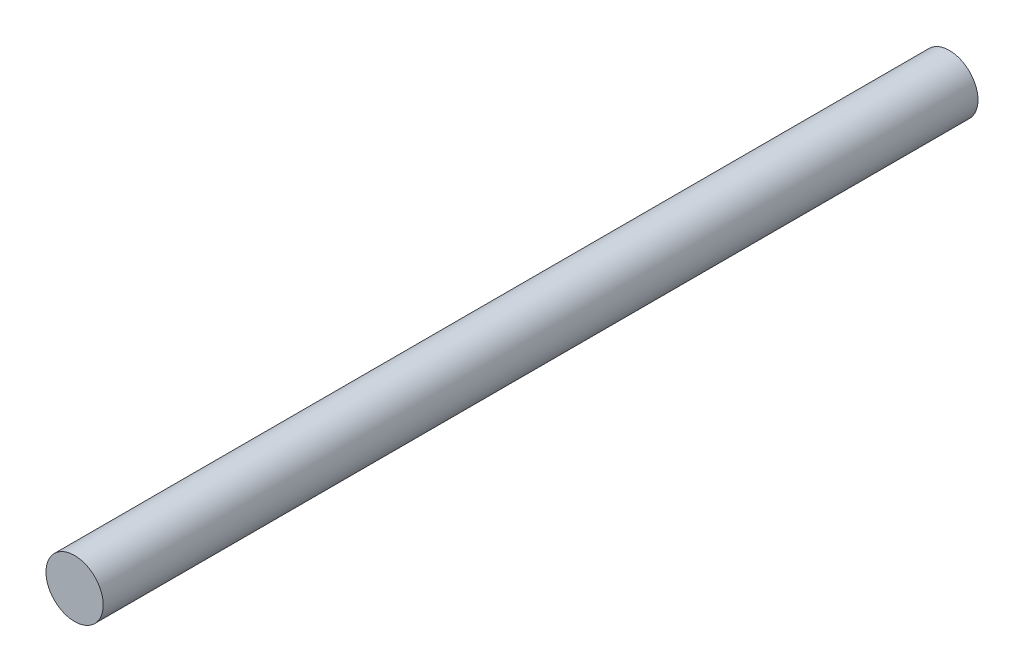
ISO-10303-21;
HEADER;
FILE_DESCRIPTION(('STEP AP214'),'2;1');
FILE_NAME('part.step','',(''),(''),'','','');
FILE_SCHEMA(('AUTOMOTIVE_DESIGN { 1 0 10303 214 1 1 1 1 }'));
ENDSEC;
DATA;
#1=APPLICATION_CONTEXT('core data for automotive mechanical design processes');
#2=APPLICATION_PROTOCOL_DEFINITION('international standard','automotive_design',2000,#1);
#3=PRODUCT_CONTEXT('',#1,'mechanical');
#4=PRODUCT('Part','Part','',(#3));
#5=PRODUCT_RELATED_PRODUCT_CATEGORY('part','',(#4));
#6=PRODUCT_DEFINITION_FORMATION('','',#4);
#7=PRODUCT_DEFINITION_CONTEXT('part definition',#1,'design');
#8=PRODUCT_DEFINITION('design','',#6,#7);
#9=PRODUCT_DEFINITION_SHAPE('','',#8);
#10=(LENGTH_UNIT() NAMED_UNIT(*) SI_UNIT(.MILLI.,.METRE.));
#11=(NAMED_UNIT(*) PLANE_ANGLE_UNIT() SI_UNIT($,.RADIAN.));
#12=(NAMED_UNIT(*) SI_UNIT($,.STERADIAN.) SOLID_ANGLE_UNIT());
#13=UNCERTAINTY_MEASURE_WITH_UNIT(LENGTH_MEASURE(1.E-05),#10,'distance_accuracy_value','');
#14=(GEOMETRIC_REPRESENTATION_CONTEXT(3) GLOBAL_UNCERTAINTY_ASSIGNED_CONTEXT((#13)) GLOBAL_UNIT_ASSIGNED_CONTEXT((#10,
#11,#12)) REPRESENTATION_CONTEXT('',''));
#15=CARTESIAN_POINT('',(0.,0.,0.));
#16=DIRECTION('',(0.,0.,1.));
#17=DIRECTION('',(1.,0.,0.));
#18=AXIS2_PLACEMENT_3D('',#15,#16,#17);
#19=CARTESIAN_POINT('',(0.,0.,48.5));
#20=DIRECTION('',(0.,0.,-1.));
#21=DIRECTION('',(-1.,0.,0.));
#22=AXIS2_PLACEMENT_3D('',#19,#20,#21);
#23=CYLINDRICAL_SURFACE('',#22,3.175);
#24=CARTESIAN_POINT('',(0.,0.,48.5));
#25=DIRECTION('',(0.,0.,1.));
#26=DIRECTION('',(1.,0.,0.));
#27=AXIS2_PLACEMENT_3D('',#24,#25,#26);
#28=CIRCLE('',#27,3.175);
#29=CARTESIAN_POINT('',(3.175,0.,48.5));
#30=VERTEX_POINT('',#29);
#31=EDGE_CURVE('E10',#30,#30,#28,.T.);
#32=ORIENTED_EDGE('',*,*,#31,.F.);
#33=EDGE_LOOP('',(#32));
#34=FACE_BOUND('',#33,.T.);
#35=CARTESIAN_POINT('',(0.,0.,-48.5));
#36=DIRECTION('',(0.,0.,1.));
#37=DIRECTION('',(1.,0.,0.));
#38=AXIS2_PLACEMENT_3D('',#35,#36,#37);
#39=CIRCLE('',#38,3.175);
#40=CARTESIAN_POINT('',(3.175,0.,-48.5));
#41=VERTEX_POINT('',#40);
#42=EDGE_CURVE('E33',#41,#41,#39,.T.);
#43=ORIENTED_EDGE('',*,*,#42,.T.);
#44=EDGE_LOOP('',(#43));
#45=FACE_BOUND('',#44,.T.);
#46=ADVANCED_FACE('F30',(#34,#45),#23,.T.);
#47=CARTESIAN_POINT('',(0.,0.,48.5));
#48=DIRECTION('',(0.,0.,1.));
#49=DIRECTION('',(1.,0.,0.));
#50=AXIS2_PLACEMENT_3D('',#47,#48,#49);
#51=PLANE('',#50);
#52=ORIENTED_EDGE('',*,*,#31,.T.);
#53=EDGE_LOOP('',(#52));
#54=FACE_BOUND('',#53,.T.);
#55=ADVANCED_FACE('F45',(#54),#51,.T.);
#56=CARTESIAN_POINT('',(0.,0.,-48.5));
#57=DIRECTION('',(0.,0.,1.));
#58=DIRECTION('',(1.,0.,0.));
#59=AXIS2_PLACEMENT_3D('',#56,#57,#58);
#60=PLANE('',#59);
#61=ORIENTED_EDGE('',*,*,#42,.F.);
#62=EDGE_LOOP('',(#61));
#63=FACE_BOUND('',#62,.T.);
#64=ADVANCED_FACE('F43',(#63),#60,.F.);
#65=CLOSED_SHELL('',(#46,#55,#64));
#66=MANIFOLD_SOLID_BREP('B2',#65);
#67=ADVANCED_BREP_SHAPE_REPRESENTATION('',(#18,#66),#14);
#68=SHAPE_DEFINITION_REPRESENTATION(#9,#67);
ENDSEC;
END-ISO-10303-21;
